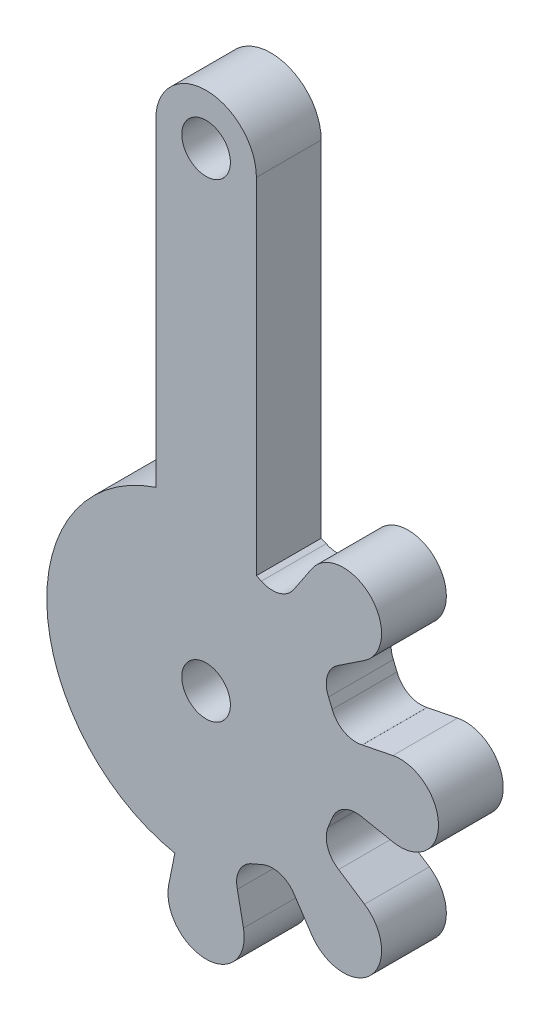
ISO-10303-21;
HEADER;
FILE_DESCRIPTION(('STEP AP214'),'2;1');
FILE_NAME('part.step','',(''),(''),'','','');
FILE_SCHEMA(('AUTOMOTIVE_DESIGN { 1 0 10303 214 1 1 1 1 }'));
ENDSEC;
DATA;
#1=APPLICATION_CONTEXT('core data for automotive mechanical design processes');
#2=APPLICATION_PROTOCOL_DEFINITION('international standard','automotive_design',2000,#1);
#3=PRODUCT_CONTEXT('',#1,'mechanical');
#4=PRODUCT('Part','Part','',(#3));
#5=PRODUCT_RELATED_PRODUCT_CATEGORY('part','',(#4));
#6=PRODUCT_DEFINITION_FORMATION('','',#4);
#7=PRODUCT_DEFINITION_CONTEXT('part definition',#1,'design');
#8=PRODUCT_DEFINITION('design','',#6,#7);
#9=PRODUCT_DEFINITION_SHAPE('','',#8);
#10=(LENGTH_UNIT() NAMED_UNIT(*) SI_UNIT(.MILLI.,.METRE.));
#11=(NAMED_UNIT(*) PLANE_ANGLE_UNIT() SI_UNIT($,.RADIAN.));
#12=(NAMED_UNIT(*) SI_UNIT($,.STERADIAN.) SOLID_ANGLE_UNIT());
#13=UNCERTAINTY_MEASURE_WITH_UNIT(LENGTH_MEASURE(1.E-05),#10,'distance_accuracy_value','');
#14=(GEOMETRIC_REPRESENTATION_CONTEXT(3) GLOBAL_UNCERTAINTY_ASSIGNED_CONTEXT((#13)) GLOBAL_UNIT_ASSIGNED_CONTEXT((#10,
#11,#12)) REPRESENTATION_CONTEXT('',''));
#15=CARTESIAN_POINT('',(0.,0.,0.));
#16=DIRECTION('',(0.,0.,1.));
#17=DIRECTION('',(1.,0.,0.));
#18=AXIS2_PLACEMENT_3D('',#15,#16,#17);
#19=CARTESIAN_POINT('',(19.0889021483885,17.7965675448827,8.00000018998981));
#20=DIRECTION('',(0.,0.,-1.));
#21=DIRECTION('',(-1.,0.,0.));
#22=AXIS2_PLACEMENT_3D('',#19,#20,#21);
#23=CYLINDRICAL_SURFACE('',#22,1.56930232516335);
#24=CARTESIAN_POINT('',(19.0889021483885,17.7965675448827,4.00000018998981));
#25=DIRECTION('',(0.,0.,1.));
#26=DIRECTION('',(1.,0.,0.));
#27=AXIS2_PLACEMENT_3D('',#24,#25,#26);
#28=CIRCLE('',#27,1.56930232516335);
#29=CARTESIAN_POINT('',(17.6195717532725,17.2454069714097,4.00000018998981));
#30=VERTEX_POINT('',#29);
#31=CARTESIAN_POINT('',(19.4732207047145,16.2750521703214,4.00000018998981));
#32=VERTEX_POINT('',#31);
#33=EDGE_CURVE('E277',#30,#32,#28,.T.);
#34=ORIENTED_EDGE('',*,*,#33,.F.);
#35=DIRECTION('',(0.,0.,-1.));
#36=VECTOR('',#35,1.);
#37=CARTESIAN_POINT('',(17.6195717532725,17.2454069714097,8.00000018998981));
#38=LINE('',#37,#36);
#39=CARTESIAN_POINT('',(17.6195717532725,17.2454069714097,8.00000018998981));
#40=VERTEX_POINT('',#39);
#41=EDGE_CURVE('E11',#40,#30,#38,.T.);
#42=ORIENTED_EDGE('',*,*,#41,.F.);
#43=CARTESIAN_POINT('',(19.0889021483885,17.7965675448827,8.00000018998981));
#44=DIRECTION('',(0.,0.,1.));
#45=DIRECTION('',(1.,0.,0.));
#46=AXIS2_PLACEMENT_3D('',#43,#44,#45);
#47=CIRCLE('',#46,1.56930232516335);
#48=CARTESIAN_POINT('',(19.4732207047145,16.2750521703214,8.00000018998981));
#49=VERTEX_POINT('',#48);
#50=EDGE_CURVE('E390',#40,#49,#47,.T.);
#51=ORIENTED_EDGE('',*,*,#50,.T.);
#52=DIRECTION('',(0.,0.,-1.));
#53=VECTOR('',#52,1.);
#54=CARTESIAN_POINT('',(19.4732207047145,16.2750521703214,8.00000018998981));
#55=LINE('',#54,#53);
#56=EDGE_CURVE('E160',#49,#32,#55,.T.);
#57=ORIENTED_EDGE('',*,*,#56,.T.);
#58=EDGE_LOOP('',(#34,#42,#51,#57));
#59=FACE_BOUND('',#58,.T.);
#60=ADVANCED_FACE('F45',(#59),#23,.F.);
#61=CARTESIAN_POINT('',(21.1359924546618,8.78995775442313,8.00000018998981));
#62=DIRECTION('',(0.923335813994052,0.38399345644938,0.));
#63=DIRECTION('',(-0.38399345644938,0.923335813994052,0.));
#64=AXIS2_PLACEMENT_3D('',#61,#62,#63);
#65=PLANE('',#64);
#66=DIRECTION('',(0.38399345644938,-0.923335813994052,0.));
#67=VECTOR('',#66,1.);
#68=CARTESIAN_POINT('',(21.1359924546618,8.78995775442313,4.00000018998981));
#69=LINE('',#68,#67);
#70=CARTESIAN_POINT('',(17.3903571485112,17.7965675448827,4.00000018998981));
#71=VERTEX_POINT('',#70);
#72=EDGE_CURVE('E281',#71,#30,#69,.T.);
#73=ORIENTED_EDGE('',*,*,#72,.F.);
#74=DIRECTION('',(0.,0.,-1.));
#75=VECTOR('',#74,1.);
#76=CARTESIAN_POINT('',(17.3903571485112,17.7965675448827,8.00000018998981));
#77=LINE('',#76,#75);
#78=CARTESIAN_POINT('',(17.3903571485112,17.7965675448827,8.00000018998981));
#79=VERTEX_POINT('',#78);
#80=EDGE_CURVE('E54',#79,#71,#77,.T.);
#81=ORIENTED_EDGE('',*,*,#80,.F.);
#82=DIRECTION('',(0.38399345644938,-0.923335813994052,0.));
#83=VECTOR('',#82,1.);
#84=CARTESIAN_POINT('',(21.1359924546618,8.78995775442313,8.00000018998981));
#85=LINE('',#84,#83);
#86=EDGE_CURVE('E495',#79,#40,#85,.T.);
#87=ORIENTED_EDGE('',*,*,#86,.T.);
#88=ORIENTED_EDGE('',*,*,#41,.T.);
#89=EDGE_LOOP('',(#73,#81,#87,#88));
#90=FACE_BOUND('',#89,.T.);
#91=ADVANCED_FACE('F482',(#90),#65,.T.);
#92=CARTESIAN_POINT('',(18.8341728434467,18.4448450137973,8.00000018998981));
#93=DIRECTION('',(0.,0.,-1.));
#94=DIRECTION('',(-1.,0.,0.));
#95=AXIS2_PLACEMENT_3D('',#92,#93,#94);
#96=CYLINDRICAL_SURFACE('',#95,1.58267730053989);
#97=CARTESIAN_POINT('',(18.8341728434467,18.4448450137973,4.00000018998981));
#98=DIRECTION('',(0.,0.,1.));
#99=DIRECTION('',(1.,0.,0.));
#100=AXIS2_PLACEMENT_3D('',#97,#98,#99);
#101=CIRCLE('',#100,1.58267730053989);
#102=CARTESIAN_POINT('',(18.0128887879995,19.7977529699837,4.00000018998981));
#103=VERTEX_POINT('',#102);
#104=EDGE_CURVE('E285',#103,#71,#101,.T.);
#105=ORIENTED_EDGE('',*,*,#104,.F.);
#106=DIRECTION('',(0.,0.,-1.));
#107=VECTOR('',#106,1.);
#108=CARTESIAN_POINT('',(18.0128887879995,19.7977529699837,8.00000018998981));
#109=LINE('',#108,#107);
#110=CARTESIAN_POINT('',(18.0128887879995,19.7977529699837,8.00000018998981));
#111=VERTEX_POINT('',#110);
#112=EDGE_CURVE('E469',#111,#103,#109,.T.);
#113=ORIENTED_EDGE('',*,*,#112,.F.);
#114=CARTESIAN_POINT('',(18.8341728434467,18.4448450137973,8.00000018998981));
#115=DIRECTION('',(0.,0.,1.));
#116=DIRECTION('',(1.,0.,0.));
#117=AXIS2_PLACEMENT_3D('',#114,#115,#116);
#118=CIRCLE('',#117,1.58267730053989);
#119=EDGE_CURVE('E478',#111,#79,#118,.T.);
#120=ORIENTED_EDGE('',*,*,#119,.T.);
#121=ORIENTED_EDGE('',*,*,#80,.T.);
#122=EDGE_LOOP('',(#105,#113,#120,#121));
#123=FACE_BOUND('',#122,.T.);
#124=ADVANCED_FACE('F476',(#123),#96,.F.);
#125=CARTESIAN_POINT('',(-3.61433091656492,5.44693007386166,8.00000018998981));
#126=DIRECTION('',(0.552903184454799,-0.833245503210034,0.));
#127=DIRECTION('',(0.833245503210034,0.552903184454799,0.));
#128=AXIS2_PLACEMENT_3D('',#125,#126,#127);
#129=PLANE('',#128);
#130=DIRECTION('',(-0.833245503210034,-0.552903184454799,0.));
#131=VECTOR('',#130,1.);
#132=CARTESIAN_POINT('',(-3.61433091656492,5.44693007386166,4.00000018998981));
#133=LINE('',#132,#131);
#134=CARTESIAN_POINT('',(19.6112202821815,20.8583318384481,4.00000018998981));
#135=VERTEX_POINT('',#134);
#136=EDGE_CURVE('E289',#135,#103,#133,.T.);
#137=ORIENTED_EDGE('',*,*,#136,.F.);
#138=DIRECTION('',(0.,0.,-1.));
#139=VECTOR('',#138,1.);
#140=CARTESIAN_POINT('',(19.6112202821815,20.8583318384481,8.00000018998981));
#141=LINE('',#140,#139);
#142=CARTESIAN_POINT('',(19.6112202821815,20.8583318384481,8.00000018998981));
#143=VERTEX_POINT('',#142);
#144=EDGE_CURVE('E466',#143,#135,#141,.T.);
#145=ORIENTED_EDGE('',*,*,#144,.F.);
#146=DIRECTION('',(-0.833245503210034,-0.552903184454799,0.));
#147=VECTOR('',#146,1.);
#148=CARTESIAN_POINT('',(-3.61433091656492,5.44693007386166,8.00000018998981));
#149=LINE('',#148,#147);
#150=EDGE_CURVE('E494',#143,#111,#149,.T.);
#151=ORIENTED_EDGE('',*,*,#150,.T.);
#152=ORIENTED_EDGE('',*,*,#112,.T.);
#153=EDGE_LOOP('',(#137,#145,#151,#152));
#154=FACE_BOUND('',#153,.T.);
#155=ADVANCED_FACE('F490',(#154),#129,.T.);
#156=CARTESIAN_POINT('',(18.3097118795859,22.8197530317846,8.00000018998981));
#157=DIRECTION('',(0.,0.,-1.));
#158=DIRECTION('',(-1.,0.,0.));
#159=AXIS2_PLACEMENT_3D('',#156,#157,#158);
#160=CYLINDRICAL_SURFACE('',#159,2.35395352963824);
#161=CARTESIAN_POINT('',(18.3097118795859,22.8197530317846,4.00000018998981));
#162=DIRECTION('',(0.,0.,1.));
#163=DIRECTION('',(1.,0.,0.));
#164=AXIS2_PLACEMENT_3D('',#161,#162,#163);
#165=CIRCLE('',#164,2.35395352963824);
#166=CARTESIAN_POINT('',(16.3503750204185,24.1243971564424,4.00000018998981));
#167=VERTEX_POINT('',#166);
#168=EDGE_CURVE('E293',#135,#167,#165,.T.);
#169=ORIENTED_EDGE('',*,*,#168,.T.);
#170=DIRECTION('',(0.,0.,-1.));
#171=VECTOR('',#170,1.);
#172=CARTESIAN_POINT('',(16.3503750204185,24.1243971564424,8.00000018998981));
#173=LINE('',#172,#171);
#174=CARTESIAN_POINT('',(16.3503750204185,24.1243971564424,8.00000018998981));
#175=VERTEX_POINT('',#174);
#176=EDGE_CURVE('E462',#175,#167,#173,.T.);
#177=ORIENTED_EDGE('',*,*,#176,.F.);
#178=CARTESIAN_POINT('',(18.3097118795859,22.8197530317846,8.00000018998981));
#179=DIRECTION('',(0.,0.,1.));
#180=DIRECTION('',(1.,0.,0.));
#181=AXIS2_PLACEMENT_3D('',#178,#179,#180);
#182=CIRCLE('',#181,2.35395352963824);
#183=EDGE_CURVE('E500',#143,#175,#182,.T.);
#184=ORIENTED_EDGE('',*,*,#183,.F.);
#185=ORIENTED_EDGE('',*,*,#144,.T.);
#186=EDGE_LOOP('',(#169,#177,#184,#185));
#187=FACE_BOUND('',#186,.T.);
#188=ADVANCED_FACE('F595',(#187),#160,.T.);
#189=CARTESIAN_POINT('',(0.198772996920888,-0.132354996212168,8.00000018998981));
#190=DIRECTION('',(0.832360042157906,-0.554235293191339,0.));
#191=DIRECTION('',(0.554235293191339,0.832360042157906,0.));
#192=AXIS2_PLACEMENT_3D('',#189,#190,#191);
#193=PLANE('',#192);
#194=DIRECTION('',(-0.554235293191339,-0.832360042157906,0.));
#195=VECTOR('',#194,1.);
#196=CARTESIAN_POINT('',(0.198772996920888,-0.132354996212168,4.00000018998981));
#197=LINE('',#196,#195);
#198=CARTESIAN_POINT('',(15.2851562947721,22.524633456298,4.00000018998981));
#199=VERTEX_POINT('',#198);
#200=EDGE_CURVE('E296',#167,#199,#197,.T.);
#201=ORIENTED_EDGE('',*,*,#200,.T.);
#202=DIRECTION('',(0.,0.,-1.));
#203=VECTOR('',#202,1.);
#204=CARTESIAN_POINT('',(15.2851562947721,22.524633456298,8.00000018998981));
#205=LINE('',#204,#203);
#206=CARTESIAN_POINT('',(15.2851562947721,22.524633456298,8.00000018998981));
#207=VERTEX_POINT('',#206);
#208=EDGE_CURVE('E458',#207,#199,#205,.T.);
#209=ORIENTED_EDGE('',*,*,#208,.F.);
#210=DIRECTION('',(-0.554235293191339,-0.832360042157906,0.));
#211=VECTOR('',#210,1.);
#212=CARTESIAN_POINT('',(0.198772996920888,-0.132354996212168,8.00000018998981));
#213=LINE('',#212,#211);
#214=EDGE_CURVE('E507',#175,#207,#213,.T.);
#215=ORIENTED_EDGE('',*,*,#214,.F.);
#216=ORIENTED_EDGE('',*,*,#176,.T.);
#217=EDGE_LOOP('',(#201,#209,#215,#216));
#218=FACE_BOUND('',#217,.T.);
#219=ADVANCED_FACE('F598',(#218),#193,.F.);
#220=CARTESIAN_POINT('',(9.83250101066569,14.3425418775039,8.00000018998981));
#221=DIRECTION('',(0.,0.,-1.));
#222=DIRECTION('',(-1.,0.,0.));
#223=AXIS2_PLACEMENT_3D('',#220,#221,#222);
#224=CYLINDRICAL_SURFACE('',#223,9.83250081368247);
#225=CARTESIAN_POINT('',(9.83250101066569,14.3425418775039,4.00000018998981));
#226=DIRECTION('',(0.,0.,1.));
#227=DIRECTION('',(1.,0.,0.));
#228=AXIS2_PLACEMENT_3D('',#225,#226,#227);
#229=CIRCLE('',#228,9.83250081368247);
#230=CARTESIAN_POINT('',(15.2830266027005,22.5260523113972,4.00000018998981));
#231=VERTEX_POINT('',#230);
#232=EDGE_CURVE('E299',#199,#231,#229,.T.);
#233=ORIENTED_EDGE('',*,*,#232,.T.);
#234=DIRECTION('',(0.,0.,-1.));
#235=VECTOR('',#234,1.);
#236=CARTESIAN_POINT('',(15.2830266027005,22.5260523113972,8.00000018998981));
#237=LINE('',#236,#235);
#238=CARTESIAN_POINT('',(15.2830266027005,22.5260523113972,8.00000018998981));
#239=VERTEX_POINT('',#238);
#240=EDGE_CURVE('E455',#239,#231,#237,.T.);
#241=ORIENTED_EDGE('',*,*,#240,.F.);
#242=CARTESIAN_POINT('',(9.83250101066569,14.3425418775039,8.00000018998981));
#243=DIRECTION('',(0.,0.,1.));
#244=DIRECTION('',(1.,0.,0.));
#245=AXIS2_PLACEMENT_3D('',#242,#243,#244);
#246=CIRCLE('',#245,9.83250081368247);
#247=EDGE_CURVE('E510',#207,#239,#246,.T.);
#248=ORIENTED_EDGE('',*,*,#247,.F.);
#249=ORIENTED_EDGE('',*,*,#208,.T.);
#250=EDGE_LOOP('',(#233,#241,#248,#249));
#251=FACE_BOUND('',#250,.T.);
#252=ADVANCED_FACE('F602',(#251),#224,.T.);
#253=CARTESIAN_POINT('',(13.9353991992036,23.3301692181327,8.00000018998981));
#254=DIRECTION('',(0.,0.,-1.));
#255=DIRECTION('',(-1.,0.,0.));
#256=AXIS2_PLACEMENT_3D('',#253,#254,#255);
#257=CYLINDRICAL_SURFACE('',#256,1.56930035950858);
#258=CARTESIAN_POINT('',(13.9353991992036,23.3301692181327,4.00000018998981));
#259=DIRECTION('',(0.,0.,1.));
#260=DIRECTION('',(1.,0.,0.));
#261=AXIS2_PLACEMENT_3D('',#258,#259,#260);
#262=CIRCLE('',#261,1.56930035950858);
#263=CARTESIAN_POINT('',(13.2481702620322,21.9193467607456,4.00000018998981));
#264=VERTEX_POINT('',#263);
#265=EDGE_CURVE('E303',#264,#231,#262,.T.);
#266=ORIENTED_EDGE('',*,*,#265,.F.);
#267=DIRECTION('',(0.,0.,-1.));
#268=VECTOR('',#267,1.);
#269=CARTESIAN_POINT('',(13.2481702620322,21.9193467607456,8.00000018998981));
#270=LINE('',#269,#268);
#271=CARTESIAN_POINT('',(13.2481702620322,21.9193467607456,8.00000018998981));
#272=VERTEX_POINT('',#271);
#273=EDGE_CURVE('E452',#272,#264,#270,.T.);
#274=ORIENTED_EDGE('',*,*,#273,.F.);
#275=CARTESIAN_POINT('',(13.9353991992036,23.3301692181327,8.00000018998981));
#276=DIRECTION('',(0.,0.,1.));
#277=DIRECTION('',(1.,0.,0.));
#278=AXIS2_PLACEMENT_3D('',#275,#276,#277);
#279=CIRCLE('',#278,1.56930035950858);
#280=EDGE_CURVE('E513',#272,#239,#279,.T.);
#281=ORIENTED_EDGE('',*,*,#280,.T.);
#282=ORIENTED_EDGE('',*,*,#240,.T.);
#283=EDGE_LOOP('',(#266,#274,#281,#282));
#284=FACE_BOUND('',#283,.T.);
#285=ADVANCED_FACE('F606',(#284),#257,.F.);
#286=CARTESIAN_POINT('',(9.90775496170879,23.3374945485105,8.00000018998981));
#287=DIRECTION('',(0.390783807057663,0.920482490947828,0.));
#288=DIRECTION('',(-0.920482490947828,0.390783807057663,0.));
#289=AXIS2_PLACEMENT_3D('',#286,#287,#288);
#290=PLANE('',#289);
#291=DIRECTION('',(0.920482490947828,-0.390783807057663,0.));
#292=VECTOR('',#291,1.);
#293=CARTESIAN_POINT('',(9.90775496170879,23.3374945485105,4.00000018998981));
#294=LINE('',#293,#292);
#295=CARTESIAN_POINT('',(12.937500141561,22.0512393862009,4.00000018998981));
#296=VERTEX_POINT('',#295);
#297=EDGE_CURVE('E307',#296,#264,#294,.T.);
#298=ORIENTED_EDGE('',*,*,#297,.F.);
#299=DIRECTION('',(0.,0.,-1.));
#300=VECTOR('',#299,1.);
#301=CARTESIAN_POINT('',(12.937500141561,22.0512393862009,8.00000018998981));
#302=LINE('',#301,#300);
#303=CARTESIAN_POINT('',(12.937500141561,22.0512393862009,8.00000018998981));
#304=VERTEX_POINT('',#303);
#305=EDGE_CURVE('E449',#304,#296,#302,.T.);
#306=ORIENTED_EDGE('',*,*,#305,.F.);
#307=DIRECTION('',(0.920482490947828,-0.390783807057663,0.));
#308=VECTOR('',#307,1.);
#309=CARTESIAN_POINT('',(9.90775496170879,23.3374945485105,8.00000018998981));
#310=LINE('',#309,#308);
#311=EDGE_CURVE('E517',#304,#272,#310,.T.);
#312=ORIENTED_EDGE('',*,*,#311,.T.);
#313=ORIENTED_EDGE('',*,*,#273,.T.);
#314=EDGE_LOOP('',(#298,#306,#312,#313));
#315=FACE_BOUND('',#314,.T.);
#316=ADVANCED_FACE('F610',(#315),#290,.T.);
#317=CARTESIAN_POINT('',(12.9375001415587,-1.38479881519464E-12,8.00000018998981));
#318=DIRECTION('',(1.,-1.07037588409085E-13,0.));
#319=DIRECTION('',(1.07037588409085E-13,1.,0.));
#320=AXIS2_PLACEMENT_3D('',#317,#318,#319);
#321=PLANE('',#320);
#322=DIRECTION('',(-1.07037588409085E-13,-1.,0.));
#323=VECTOR('',#322,1.);
#324=CARTESIAN_POINT('',(12.9375001415587,-1.38479881519464E-12,4.00000018998981));
#325=LINE('',#324,#323);
#326=CARTESIAN_POINT('',(12.937500141561,43.3425419032574,4.00000018998981));
#327=VERTEX_POINT('',#326);
#328=EDGE_CURVE('E311',#327,#296,#325,.T.);
#329=ORIENTED_EDGE('',*,*,#328,.F.);
#330=DIRECTION('',(0.,0.,-1.));
#331=VECTOR('',#330,1.);
#332=CARTESIAN_POINT('',(12.937500141561,43.3425419032574,8.00000018998981));
#333=LINE('',#332,#331);
#334=CARTESIAN_POINT('',(12.937500141561,43.3425419032574,8.00000018998981));
#335=VERTEX_POINT('',#334);
#336=EDGE_CURVE('E446',#335,#327,#333,.T.);
#337=ORIENTED_EDGE('',*,*,#336,.F.);
#338=DIRECTION('',(-1.07037588409085E-13,-1.,0.));
#339=VECTOR('',#338,1.);
#340=CARTESIAN_POINT('',(12.9375001415587,-1.38479881519464E-12,8.00000018998981));
#341=LINE('',#340,#339);
#342=EDGE_CURVE('E521',#335,#304,#341,.T.);
#343=ORIENTED_EDGE('',*,*,#342,.T.);
#344=ORIENTED_EDGE('',*,*,#305,.T.);
#345=EDGE_LOOP('',(#329,#337,#343,#344));
#346=FACE_BOUND('',#345,.T.);
#347=ADVANCED_FACE('F614',(#346),#321,.T.);
#348=CARTESIAN_POINT('',(9.83250024728477,43.3425408664107,8.00000018998981));
#349=DIRECTION('',(0.,0.,-1.));
#350=DIRECTION('',(-1.,0.,0.));
#351=AXIS2_PLACEMENT_3D('',#348,#349,#350);
#352=CYLINDRICAL_SURFACE('',#351,3.10499989427643);
#353=CARTESIAN_POINT('',(9.83250024728477,43.3425408664107,4.00000018998981));
#354=DIRECTION('',(0.,0.,1.));
#355=DIRECTION('',(1.,0.,0.));
#356=AXIS2_PLACEMENT_3D('',#353,#354,#355);
#357=CIRCLE('',#356,3.10499989427643);
#358=CARTESIAN_POINT('',(6.72750035300834,43.3425408664107,4.00000018998981));
#359=VERTEX_POINT('',#358);
#360=EDGE_CURVE('E315',#327,#359,#357,.T.);
#361=ORIENTED_EDGE('',*,*,#360,.T.);
#362=DIRECTION('',(0.,0.,-1.));
#363=VECTOR('',#362,1.);
#364=CARTESIAN_POINT('',(6.72750035300834,43.3425408664107,8.00000018998981));
#365=LINE('',#364,#363);
#366=CARTESIAN_POINT('',(6.72750035300834,43.3425408664107,8.00000018998981));
#367=VERTEX_POINT('',#366);
#368=EDGE_CURVE('E442',#367,#359,#365,.T.);
#369=ORIENTED_EDGE('',*,*,#368,.F.);
#370=CARTESIAN_POINT('',(9.83250024728477,43.3425408664107,8.00000018998981));
#371=DIRECTION('',(0.,0.,1.));
#372=DIRECTION('',(1.,0.,0.));
#373=AXIS2_PLACEMENT_3D('',#370,#371,#372);
#374=CIRCLE('',#373,3.10499989427643);
#375=EDGE_CURVE('E525',#335,#367,#374,.T.);
#376=ORIENTED_EDGE('',*,*,#375,.F.);
#377=ORIENTED_EDGE('',*,*,#336,.T.);
#378=EDGE_LOOP('',(#361,#369,#376,#377));
#379=FACE_BOUND('',#378,.T.);
#380=ADVANCED_FACE('F618',(#379),#352,.T.);
#381=CARTESIAN_POINT('',(6.72750035300834,0.,8.00000018998981));
#382=DIRECTION('',(1.,0.,0.));
#383=DIRECTION('',(0.,0.,-1.));
#384=AXIS2_PLACEMENT_3D('',#381,#382,#383);
#385=PLANE('',#384);
#386=DIRECTION('',(0.,-1.,0.));
#387=VECTOR('',#386,1.);
#388=CARTESIAN_POINT('',(6.72750035300834,0.,4.00000018998981));
#389=LINE('',#388,#387);
#390=CARTESIAN_POINT('',(6.72750035300834,23.6719064414501,4.00000018998981));
#391=VERTEX_POINT('',#390);
#392=EDGE_CURVE('E318',#359,#391,#389,.T.);
#393=ORIENTED_EDGE('',*,*,#392,.T.);
#394=DIRECTION('',(0.,0.,-1.));
#395=VECTOR('',#394,1.);
#396=CARTESIAN_POINT('',(6.72750035300834,23.6719064414501,8.00000018998981));
#397=LINE('',#396,#395);
#398=CARTESIAN_POINT('',(6.72750035300834,23.6719064414501,8.00000018998981));
#399=VERTEX_POINT('',#398);
#400=EDGE_CURVE('E438',#399,#391,#397,.T.);
#401=ORIENTED_EDGE('',*,*,#400,.F.);
#402=DIRECTION('',(0.,-1.,0.));
#403=VECTOR('',#402,1.);
#404=CARTESIAN_POINT('',(6.72750035300834,0.,8.00000018998981));
#405=LINE('',#404,#403);
#406=EDGE_CURVE('E528',#367,#399,#405,.T.);
#407=ORIENTED_EDGE('',*,*,#406,.F.);
#408=ORIENTED_EDGE('',*,*,#368,.T.);
#409=EDGE_LOOP('',(#393,#401,#407,#408));
#410=FACE_BOUND('',#409,.T.);
#411=ADVANCED_FACE('F622',(#410),#385,.F.);
#412=CARTESIAN_POINT('',(9.83250101066569,14.3425418775039,8.00000018998981));
#413=DIRECTION('',(0.,0.,-1.));
#414=DIRECTION('',(-1.,0.,0.));
#415=AXIS2_PLACEMENT_3D('',#412,#413,#414);
#416=CYLINDRICAL_SURFACE('',#415,9.83250081368247);
#417=CARTESIAN_POINT('',(9.83250101066569,14.3425418775039,4.00000018998981));
#418=DIRECTION('',(0.,0.,1.));
#419=DIRECTION('',(1.,0.,0.));
#420=AXIS2_PLACEMENT_3D('',#417,#418,#419);
#421=CIRCLE('',#420,9.83250081368247);
#422=CARTESIAN_POINT('',(7.90210532729955,4.70139854506105,4.00000018998981));
#423=VERTEX_POINT('',#422);
#424=EDGE_CURVE('E321',#391,#423,#421,.T.);
#425=ORIENTED_EDGE('',*,*,#424,.T.);
#426=DIRECTION('',(0.,0.,-1.));
#427=VECTOR('',#426,1.);
#428=CARTESIAN_POINT('',(7.90210532729955,4.70139854506105,8.00000018998981));
#429=LINE('',#428,#427);
#430=CARTESIAN_POINT('',(7.90210532729955,4.70139854506105,8.00000018998981));
#431=VERTEX_POINT('',#430);
#432=EDGE_CURVE('E435',#431,#423,#429,.T.);
#433=ORIENTED_EDGE('',*,*,#432,.F.);
#434=CARTESIAN_POINT('',(9.83250101066569,14.3425418775039,8.00000018998981));
#435=DIRECTION('',(0.,0.,1.));
#436=DIRECTION('',(1.,0.,0.));
#437=AXIS2_PLACEMENT_3D('',#434,#435,#436);
#438=CIRCLE('',#437,9.83250081368247);
#439=EDGE_CURVE('E531',#399,#431,#438,.T.);
#440=ORIENTED_EDGE('',*,*,#439,.F.);
#441=ORIENTED_EDGE('',*,*,#400,.T.);
#442=EDGE_LOOP('',(#425,#433,#440,#441));
#443=FACE_BOUND('',#442,.T.);
#444=ADVANCED_FACE('F626',(#443),#416,.T.);
#445=CARTESIAN_POINT('',(6.69148391120007,-1.34072874359812,8.00000018998981));
#446=DIRECTION('',(-0.980512085332624,0.196458775616336,0.));
#447=DIRECTION('',(-0.196458775616336,-0.980512085332624,0.));
#448=AXIS2_PLACEMENT_3D('',#445,#446,#447);
#449=PLANE('',#448);
#450=DIRECTION('',(0.196458775616336,0.980512085332624,0.));
#451=VECTOR('',#450,1.);
#452=CARTESIAN_POINT('',(6.69148391120007,-1.34072874359812,4.00000018998981));
#453=LINE('',#452,#451);
#454=CARTESIAN_POINT('',(7.52442178923231,2.81640627457414,4.00000018998981));
#455=VERTEX_POINT('',#454);
#456=EDGE_CURVE('E325',#455,#423,#453,.T.);
#457=ORIENTED_EDGE('',*,*,#456,.F.);
#458=DIRECTION('',(0.,0.,-1.));
#459=VECTOR('',#458,1.);
#460=CARTESIAN_POINT('',(7.52442178923231,2.81640627457414,8.00000018998981));
#461=LINE('',#460,#459);
#462=CARTESIAN_POINT('',(7.52442178923231,2.81640627457414,8.00000018998981));
#463=VERTEX_POINT('',#462);
#464=EDGE_CURVE('E432',#463,#455,#461,.T.);
#465=ORIENTED_EDGE('',*,*,#464,.F.);
#466=DIRECTION('',(0.196458775616336,0.980512085332624,0.));
#467=VECTOR('',#466,1.);
#468=CARTESIAN_POINT('',(6.69148391120007,-1.34072874359812,8.00000018998981));
#469=LINE('',#468,#467);
#470=EDGE_CURVE('E534',#463,#431,#469,.T.);
#471=ORIENTED_EDGE('',*,*,#470,.T.);
#472=ORIENTED_EDGE('',*,*,#432,.T.);
#473=EDGE_LOOP('',(#457,#465,#471,#472));
#474=FACE_BOUND('',#473,.T.);
#475=ADVANCED_FACE('F630',(#474),#449,.T.);
#476=CARTESIAN_POINT('',(9.83250001445413,2.35395177866654,8.00000018998981));
#477=DIRECTION('',(0.,0.,-1.));
#478=DIRECTION('',(-1.,0.,0.));
#479=AXIS2_PLACEMENT_3D('',#476,#477,#478);
#480=CYLINDRICAL_SURFACE('',#479,2.35395183776734);
#481=CARTESIAN_POINT('',(9.83250001445413,2.35395177866654,4.00000018998981));
#482=DIRECTION('',(0.,0.,1.));
#483=DIRECTION('',(1.,0.,0.));
#484=AXIS2_PLACEMENT_3D('',#481,#482,#483);
#485=CIRCLE('',#484,2.35395183776734);
#486=CARTESIAN_POINT('',(12.1405782396759,2.81640627457414,4.00000018998981));
#487=VERTEX_POINT('',#486);
#488=EDGE_CURVE('E329',#455,#487,#485,.T.);
#489=ORIENTED_EDGE('',*,*,#488,.T.);
#490=DIRECTION('',(0.,0.,-1.));
#491=VECTOR('',#490,1.);
#492=CARTESIAN_POINT('',(12.1405782396759,2.81640627457414,8.00000018998981));
#493=LINE('',#492,#491);
#494=CARTESIAN_POINT('',(12.1405782396759,2.81640627457414,8.00000018998981));
#495=VERTEX_POINT('',#494);
#496=EDGE_CURVE('E428',#495,#487,#493,.T.);
#497=ORIENTED_EDGE('',*,*,#496,.F.);
#498=CARTESIAN_POINT('',(9.83250001445413,2.35395177866654,8.00000018998981));
#499=DIRECTION('',(0.,0.,1.));
#500=DIRECTION('',(1.,0.,0.));
#501=AXIS2_PLACEMENT_3D('',#498,#499,#500);
#502=CIRCLE('',#501,2.35395183776734);
#503=EDGE_CURVE('E538',#463,#495,#502,.T.);
#504=ORIENTED_EDGE('',*,*,#503,.F.);
#505=ORIENTED_EDGE('',*,*,#464,.T.);
#506=EDGE_LOOP('',(#489,#497,#504,#505));
#507=FACE_BOUND('',#506,.T.);
#508=ADVANCED_FACE('F634',(#507),#480,.T.);
#509=CARTESIAN_POINT('',(12.2145247831821,2.44734421893973,8.00000018998981));
#510=DIRECTION('',(-0.980512085332624,-0.196458775616335,0.));
#511=DIRECTION('',(0.196458775616335,-0.980512085332624,0.));
#512=AXIS2_PLACEMENT_3D('',#509,#510,#511);
#513=PLANE('',#512);
#514=DIRECTION('',(-0.196458775616335,0.980512085332624,0.));
#515=VECTOR('',#514,1.);
#516=CARTESIAN_POINT('',(12.2145247831821,2.44734421893973,4.00000018998981));
#517=LINE('',#516,#515);
#518=CARTESIAN_POINT('',(11.7628947784572,4.70139816151575,4.00000018998981));
#519=VERTEX_POINT('',#518);
#520=EDGE_CURVE('E332',#487,#519,#517,.T.);
#521=ORIENTED_EDGE('',*,*,#520,.T.);
#522=DIRECTION('',(0.,0.,-1.));
#523=VECTOR('',#522,1.);
#524=CARTESIAN_POINT('',(11.7628947784572,4.70139816151575,8.00000018998981));
#525=LINE('',#524,#523);
#526=CARTESIAN_POINT('',(11.7628947784572,4.70139816151575,8.00000018998981));
#527=VERTEX_POINT('',#526);
#528=EDGE_CURVE('E425',#527,#519,#525,.T.);
#529=ORIENTED_EDGE('',*,*,#528,.F.);
#530=DIRECTION('',(-0.196458775616335,0.980512085332624,0.));
#531=VECTOR('',#530,1.);
#532=CARTESIAN_POINT('',(12.2145247831821,2.44734421893973,8.00000018998981));
#533=LINE('',#532,#531);
#534=EDGE_CURVE('E541',#495,#527,#533,.T.);
#535=ORIENTED_EDGE('',*,*,#534,.F.);
#536=ORIENTED_EDGE('',*,*,#496,.T.);
#537=EDGE_LOOP('',(#521,#529,#535,#536));
#538=FACE_BOUND('',#537,.T.);
#539=ADVANCED_FACE('F638',(#538),#513,.F.);
#540=CARTESIAN_POINT('',(13.2749341416946,5.08388406319837,8.00000018998981));
#541=DIRECTION('',(0.,0.,-1.));
#542=DIRECTION('',(-1.,0.,0.));
#543=AXIS2_PLACEMENT_3D('',#540,#541,#542);
#544=CYLINDRICAL_SURFACE('',#543,1.55966615048398);
#545=CARTESIAN_POINT('',(13.2749341416946,5.08388406319837,4.00000018998981));
#546=DIRECTION('',(0.,0.,1.));
#547=DIRECTION('',(1.,0.,0.));
#548=AXIS2_PLACEMENT_3D('',#545,#546,#547);
#549=CIRCLE('',#548,1.55966615048398);
#550=CARTESIAN_POINT('',(12.7382591657406,6.54830834295825,4.00000018998981));
#551=VERTEX_POINT('',#550);
#552=EDGE_CURVE('E336',#551,#519,#549,.T.);
#553=ORIENTED_EDGE('',*,*,#552,.F.);
#554=DIRECTION('',(0.,0.,-1.));
#555=VECTOR('',#554,1.);
#556=CARTESIAN_POINT('',(12.7382591657406,6.54830834295825,8.00000018998981));
#557=LINE('',#556,#555);
#558=CARTESIAN_POINT('',(12.7382591657406,6.54830834295825,8.00000018998981));
#559=VERTEX_POINT('',#558);
#560=EDGE_CURVE('E422',#559,#551,#557,.T.);
#561=ORIENTED_EDGE('',*,*,#560,.F.);
#562=CARTESIAN_POINT('',(13.2749341416946,5.08388406319837,8.00000018998981));
#563=DIRECTION('',(0.,0.,1.));
#564=DIRECTION('',(1.,0.,0.));
#565=AXIS2_PLACEMENT_3D('',#562,#563,#564);
#566=CIRCLE('',#565,1.55966615048398);
#567=EDGE_CURVE('E544',#559,#527,#566,.T.);
#568=ORIENTED_EDGE('',*,*,#567,.T.);
#569=ORIENTED_EDGE('',*,*,#528,.T.);
#570=EDGE_LOOP('',(#553,#561,#568,#569));
#571=FACE_BOUND('',#570,.T.);
#572=ADVANCED_FACE('F642',(#571),#544,.F.);
#573=CARTESIAN_POINT('',(-0.371900803995508,0.856633436229976,8.00000018998981));
#574=DIRECTION('',(-0.398232080204369,0.917284694244977,0.));
#575=DIRECTION('',(-0.917284694244977,-0.398232080204369,0.));
#576=AXIS2_PLACEMENT_3D('',#573,#574,#575);
#577=PLANE('',#576);
#578=DIRECTION('',(0.917284694244977,0.398232080204369,0.));
#579=VECTOR('',#578,1.);
#580=CARTESIAN_POINT('',(-0.371900803995508,0.856633436229976,4.00000018998981));
#581=LINE('',#580,#579);
#582=CARTESIAN_POINT('',(13.2798130229038,6.78341977611949,4.00000018998981));
#583=VERTEX_POINT('',#582);
#584=EDGE_CURVE('E340',#551,#583,#581,.T.);
#585=ORIENTED_EDGE('',*,*,#584,.T.);
#586=DIRECTION('',(0.,0.,-1.));
#587=VECTOR('',#586,1.);
#588=CARTESIAN_POINT('',(13.2798130229038,6.78341977611949,8.00000018998981));
#589=LINE('',#588,#587);
#590=CARTESIAN_POINT('',(13.2798130229038,6.78341977611949,8.00000018998981));
#591=VERTEX_POINT('',#590);
#592=EDGE_CURVE('E419',#591,#583,#589,.T.);
#593=ORIENTED_EDGE('',*,*,#592,.F.);
#594=DIRECTION('',(0.917284694244977,0.398232080204369,0.));
#595=VECTOR('',#594,1.);
#596=CARTESIAN_POINT('',(-0.371900803995508,0.856633436229976,8.00000018998981));
#597=LINE('',#596,#595);
#598=EDGE_CURVE('E548',#559,#591,#597,.T.);
#599=ORIENTED_EDGE('',*,*,#598,.F.);
#600=ORIENTED_EDGE('',*,*,#560,.T.);
#601=EDGE_LOOP('',(#585,#593,#599,#600));
#602=FACE_BOUND('',#601,.T.);
#603=ADVANCED_FACE('F646',(#602),#577,.F.);
#604=CARTESIAN_POINT('',(13.9337755720326,5.34943795461679,8.00000018998981));
#605=DIRECTION('',(0.,0.,-1.));
#606=DIRECTION('',(-1.,0.,0.));
#607=AXIS2_PLACEMENT_3D('',#604,#605,#606);
#608=CYLINDRICAL_SURFACE('',#607,1.57606182621852);
#609=CARTESIAN_POINT('',(13.9337755720326,5.34943795461679,4.00000018998981));
#610=DIRECTION('',(0.,0.,1.));
#611=DIRECTION('',(1.,0.,0.));
#612=AXIS2_PLACEMENT_3D('',#609,#610,#611);
#613=CIRCLE('',#612,1.57606182621852);
#614=CARTESIAN_POINT('',(15.2851562947721,6.16045029870986,4.00000018998981));
#615=VERTEX_POINT('',#614);
#616=EDGE_CURVE('E344',#615,#583,#613,.T.);
#617=ORIENTED_EDGE('',*,*,#616,.F.);
#618=DIRECTION('',(0.,0.,-1.));
#619=VECTOR('',#618,1.);
#620=CARTESIAN_POINT('',(15.2851562947721,6.16045029870986,8.00000018998981));
#621=LINE('',#620,#619);
#622=CARTESIAN_POINT('',(15.2851562947721,6.16045029870986,8.00000018998981));
#623=VERTEX_POINT('',#622);
#624=EDGE_CURVE('E416',#623,#615,#621,.T.);
#625=ORIENTED_EDGE('',*,*,#624,.F.);
#626=CARTESIAN_POINT('',(13.9337755720326,5.34943795461679,8.00000018998981));
#627=DIRECTION('',(0.,0.,1.));
#628=DIRECTION('',(1.,0.,0.));
#629=AXIS2_PLACEMENT_3D('',#626,#627,#628);
#630=CIRCLE('',#629,1.57606182621852);
#631=EDGE_CURVE('E551',#623,#591,#630,.T.);
#632=ORIENTED_EDGE('',*,*,#631,.T.);
#633=ORIENTED_EDGE('',*,*,#592,.T.);
#634=EDGE_LOOP('',(#617,#625,#632,#633));
#635=FACE_BOUND('',#634,.T.);
#636=ADVANCED_FACE('F650',(#635),#608,.F.);
#637=CARTESIAN_POINT('',(13.4273745704359,8.94818203855331,8.00000018998981));
#638=DIRECTION('',(-0.832147561829666,-0.554554267264208,0.));
#639=DIRECTION('',(0.554554267264208,-0.832147561829666,0.));
#640=AXIS2_PLACEMENT_3D('',#637,#638,#639);
#641=PLANE('',#640);
#642=DIRECTION('',(-0.554554267264208,0.832147561829666,0.));
#643=VECTOR('',#642,1.);
#644=CARTESIAN_POINT('',(13.4273745704359,8.94818203855331,4.00000018998981));
#645=LINE('',#644,#643);
#646=CARTESIAN_POINT('',(16.318864329397,4.60929891202859,4.00000018998981));
#647=VERTEX_POINT('',#646);
#648=EDGE_CURVE('E348',#647,#615,#645,.T.);
#649=ORIENTED_EDGE('',*,*,#648,.F.);
#650=DIRECTION('',(0.,0.,-1.));
#651=VECTOR('',#650,1.);
#652=CARTESIAN_POINT('',(16.318864329397,4.60929891202859,8.00000018998981));
#653=LINE('',#652,#651);
#654=CARTESIAN_POINT('',(16.318864329397,4.60929891202859,8.00000018998981));
#655=VERTEX_POINT('',#654);
#656=EDGE_CURVE('E413',#655,#647,#653,.T.);
#657=ORIENTED_EDGE('',*,*,#656,.F.);
#658=DIRECTION('',(-0.554554267264208,0.832147561829666,0.));
#659=VECTOR('',#658,1.);
#660=CARTESIAN_POINT('',(13.4273745704359,8.94818203855331,8.00000018998981));
#661=LINE('',#660,#659);
#662=EDGE_CURVE('E555',#655,#623,#661,.T.);
#663=ORIENTED_EDGE('',*,*,#662,.T.);
#664=ORIENTED_EDGE('',*,*,#624,.T.);
#665=EDGE_LOOP('',(#649,#657,#663,#664));
#666=FACE_BOUND('',#665,.T.);
#667=ADVANCED_FACE('F654',(#666),#641,.T.);
#668=CARTESIAN_POINT('',(18.3097134949587,5.8653286053496,8.00000018998981));
#669=DIRECTION('',(0.,0.,-1.));
#670=DIRECTION('',(-1.,0.,0.));
#671=AXIS2_PLACEMENT_3D('',#668,#669,#670);
#672=CYLINDRICAL_SURFACE('',#671,2.35395220650753);
#673=CARTESIAN_POINT('',(18.3097134949587,5.8653286053496,4.00000018998981));
#674=DIRECTION('',(0.,0.,1.));
#675=DIRECTION('',(1.,0.,0.));
#676=AXIS2_PLACEMENT_3D('',#673,#674,#675);
#677=CIRCLE('',#676,2.35395220650753);
#678=CARTESIAN_POINT('',(19.6112234101304,7.82674720708444,4.00000018998981));
#679=VERTEX_POINT('',#678);
#680=EDGE_CURVE('E352',#647,#679,#677,.T.);
#681=ORIENTED_EDGE('',*,*,#680,.T.);
#682=DIRECTION('',(0.,0.,-1.));
#683=VECTOR('',#682,1.);
#684=CARTESIAN_POINT('',(19.6112234101304,7.82674720708444,8.00000018998981));
#685=LINE('',#684,#683);
#686=CARTESIAN_POINT('',(19.6112234101304,7.82674720708444,8.00000018998981));
#687=VERTEX_POINT('',#686);
#688=EDGE_CURVE('E409',#687,#679,#685,.T.);
#689=ORIENTED_EDGE('',*,*,#688,.F.);
#690=CARTESIAN_POINT('',(18.3097134949587,5.8653286053496,8.00000018998981));
#691=DIRECTION('',(0.,0.,1.));
#692=DIRECTION('',(1.,0.,0.));
#693=AXIS2_PLACEMENT_3D('',#690,#691,#692);
#694=CIRCLE('',#693,2.35395220650753);
#695=EDGE_CURVE('E559',#655,#687,#694,.T.);
#696=ORIENTED_EDGE('',*,*,#695,.F.);
#697=ORIENTED_EDGE('',*,*,#656,.T.);
#698=EDGE_LOOP('',(#681,#689,#696,#697));
#699=FACE_BOUND('',#698,.T.);
#700=ADVANCED_FACE('F658',(#699),#672,.T.);
#701=CARTESIAN_POINT('',(9.60102749418364,14.4690668148889,8.00000018998981));
#702=DIRECTION('',(-0.552904137804345,-0.833244870610575,0.));
#703=DIRECTION('',(0.833244870610575,-0.552904137804345,0.));
#704=AXIS2_PLACEMENT_3D('',#701,#702,#703);
#705=PLANE('',#704);
#706=DIRECTION('',(-0.833244870610575,0.552904137804345,0.));
#707=VECTOR('',#706,1.);
#708=CARTESIAN_POINT('',(9.60102749418364,14.4690668148889,4.00000018998981));
#709=LINE('',#708,#707);
#710=CARTESIAN_POINT('',(18.0128887879995,8.8873307850242,4.00000018998981));
#711=VERTEX_POINT('',#710);
#712=EDGE_CURVE('E355',#679,#711,#709,.T.);
#713=ORIENTED_EDGE('',*,*,#712,.T.);
#714=DIRECTION('',(0.,0.,-1.));
#715=VECTOR('',#714,1.);
#716=CARTESIAN_POINT('',(18.0128887879995,8.8873307850242,8.00000018998981));
#717=LINE('',#716,#715);
#718=CARTESIAN_POINT('',(18.0128887879995,8.8873307850242,8.00000018998981));
#719=VERTEX_POINT('',#718);
#720=EDGE_CURVE('E406',#719,#711,#717,.T.);
#721=ORIENTED_EDGE('',*,*,#720,.F.);
#722=DIRECTION('',(-0.833244870610575,0.552904137804345,0.));
#723=VECTOR('',#722,1.);
#724=CARTESIAN_POINT('',(9.60102749418364,14.4690668148889,8.00000018998981));
#725=LINE('',#724,#723);
#726=EDGE_CURVE('E562',#687,#719,#725,.T.);
#727=ORIENTED_EDGE('',*,*,#726,.F.);
#728=ORIENTED_EDGE('',*,*,#688,.T.);
#729=EDGE_LOOP('',(#713,#721,#727,#728));
#730=FACE_BOUND('',#729,.T.);
#731=ADVANCED_FACE('F662',(#730),#705,.F.);
#732=CARTESIAN_POINT('',(18.8341685365272,10.2402365545928,8.00000018998981));
#733=DIRECTION('',(0.,0.,-1.));
#734=DIRECTION('',(-1.,0.,0.));
#735=AXIS2_PLACEMENT_3D('',#732,#733,#734);
#736=CYLINDRICAL_SURFACE('',#735,1.58267319642232);
#737=CARTESIAN_POINT('',(18.8341685365272,10.2402365545928,4.00000018998981));
#738=DIRECTION('',(0.,0.,1.));
#739=DIRECTION('',(1.,0.,0.));
#740=AXIS2_PLACEMENT_3D('',#737,#738,#739);
#741=CIRCLE('',#740,1.58267319642232);
#742=CARTESIAN_POINT('',(17.369938896567,10.8409744409757,4.00000018998981));
#743=VERTEX_POINT('',#742);
#744=EDGE_CURVE('E359',#743,#711,#741,.T.);
#745=ORIENTED_EDGE('',*,*,#744,.F.);
#746=DIRECTION('',(0.,0.,-1.));
#747=VECTOR('',#746,1.);
#748=CARTESIAN_POINT('',(17.369938896567,10.8409744409757,8.00000018998981));
#749=LINE('',#748,#747);
#750=CARTESIAN_POINT('',(17.369938896567,10.8409744409757,8.00000018998981));
#751=VERTEX_POINT('',#750);
#752=EDGE_CURVE('E403',#751,#743,#749,.T.);
#753=ORIENTED_EDGE('',*,*,#752,.F.);
#754=CARTESIAN_POINT('',(18.8341685365272,10.2402365545928,8.00000018998981));
#755=DIRECTION('',(0.,0.,1.));
#756=DIRECTION('',(1.,0.,0.));
#757=AXIS2_PLACEMENT_3D('',#754,#755,#756);
#758=CIRCLE('',#757,1.58267319642232);
#759=EDGE_CURVE('E565',#751,#719,#758,.T.);
#760=ORIENTED_EDGE('',*,*,#759,.T.);
#761=ORIENTED_EDGE('',*,*,#720,.T.);
#762=EDGE_LOOP('',(#745,#753,#760,#761));
#763=FACE_BOUND('',#762,.T.);
#764=ADVANCED_FACE('F666',(#763),#736,.F.);
#765=CARTESIAN_POINT('',(11.0603960159855,-4.5378120643572,8.00000018998981));
#766=DIRECTION('',(-0.925162341328648,0.379571656195894,0.));
#767=DIRECTION('',(-0.379571656195894,-0.925162341328648,0.));
#768=AXIS2_PLACEMENT_3D('',#765,#766,#767);
#769=PLANE('',#768);
#770=DIRECTION('',(0.379571656195894,0.925162341328648,0.));
#771=VECTOR('',#770,1.);
#772=CARTESIAN_POINT('',(11.0603960159855,-4.5378120643572,4.00000018998981));
#773=LINE('',#772,#771);
#774=CARTESIAN_POINT('',(17.6312974778619,11.4780059817931,4.00000018998981));
#775=VERTEX_POINT('',#774);
#776=EDGE_CURVE('E363',#743,#775,#773,.T.);
#777=ORIENTED_EDGE('',*,*,#776,.T.);
#778=DIRECTION('',(0.,0.,-1.));
#779=VECTOR('',#778,1.);
#780=CARTESIAN_POINT('',(17.6312974778619,11.4780059817931,8.00000018998981));
#781=LINE('',#780,#779);
#782=CARTESIAN_POINT('',(17.6312974778619,11.4780059817931,8.00000018998981));
#783=VERTEX_POINT('',#782);
#784=EDGE_CURVE('E400',#783,#775,#781,.T.);
#785=ORIENTED_EDGE('',*,*,#784,.F.);
#786=DIRECTION('',(0.379571656195894,0.925162341328648,0.));
#787=VECTOR('',#786,1.);
#788=CARTESIAN_POINT('',(11.0603960159855,-4.5378120643572,8.00000018998981));
#789=LINE('',#788,#787);
#790=EDGE_CURVE('E569',#751,#783,#789,.T.);
#791=ORIENTED_EDGE('',*,*,#790,.F.);
#792=ORIENTED_EDGE('',*,*,#752,.T.);
#793=EDGE_LOOP('',(#777,#785,#791,#792));
#794=FACE_BOUND('',#793,.T.);
#795=ADVANCED_FACE('F670',(#794),#769,.F.);
#796=CARTESIAN_POINT('',(19.0937153075139,10.8780114372095,8.00000018998981));
#797=DIRECTION('',(0.,0.,-1.));
#798=DIRECTION('',(-1.,0.,0.));
#799=AXIS2_PLACEMENT_3D('',#796,#797,#798);
#800=CYLINDRICAL_SURFACE('',#799,1.58071482627775);
#801=CARTESIAN_POINT('',(19.0937153075139,10.8780114372095,4.00000018998981));
#802=DIRECTION('',(0.,0.,1.));
#803=DIRECTION('',(1.,0.,0.));
#804=AXIS2_PLACEMENT_3D('',#801,#802,#803);
#805=CIRCLE('',#804,1.58071482627775);
#806=CARTESIAN_POINT('',(19.4736905840118,12.4123771534794,4.00000018998981));
#807=VERTEX_POINT('',#806);
#808=EDGE_CURVE('E367',#807,#775,#805,.T.);
#809=ORIENTED_EDGE('',*,*,#808,.F.);
#810=DIRECTION('',(0.,0.,-1.));
#811=VECTOR('',#810,1.);
#812=CARTESIAN_POINT('',(19.4736905840118,12.4123771534794,8.00000018998981));
#813=LINE('',#812,#811);
#814=CARTESIAN_POINT('',(19.4736905840118,12.4123771534794,8.00000018998981));
#815=VERTEX_POINT('',#814);
#816=EDGE_CURVE('E397',#815,#807,#813,.T.);
#817=ORIENTED_EDGE('',*,*,#816,.F.);
#818=CARTESIAN_POINT('',(19.0937153075139,10.8780114372095,8.00000018998981));
#819=DIRECTION('',(0.,0.,1.));
#820=DIRECTION('',(1.,0.,0.));
#821=AXIS2_PLACEMENT_3D('',#818,#819,#820);
#822=CIRCLE('',#821,1.58071482627775);
#823=EDGE_CURVE('E572',#815,#783,#822,.T.);
#824=ORIENTED_EDGE('',*,*,#823,.T.);
#825=ORIENTED_EDGE('',*,*,#784,.T.);
#826=EDGE_LOOP('',(#809,#817,#824,#825));
#827=FACE_BOUND('',#826,.T.);
#828=ADVANCED_FACE('F674',(#827),#800,.F.);
#829=CARTESIAN_POINT('',(3.14493202099581,15.686147032239,8.00000018998981));
#830=DIRECTION('',(-0.19657905979497,-0.980487977106362,0.));
#831=DIRECTION('',(0.980487977106362,-0.19657905979497,0.));
#832=AXIS2_PLACEMENT_3D('',#829,#830,#831);
#833=PLANE('',#832);
#834=DIRECTION('',(-0.980487977106362,0.19657905979497,0.));
#835=VECTOR('',#834,1.);
#836=CARTESIAN_POINT('',(3.14493202099581,15.686147032239,4.00000018998981));
#837=LINE('',#836,#835);
#838=CARTESIAN_POINT('',(21.3583526675108,12.0345192816278,4.00000018998981));
#839=VERTEX_POINT('',#838);
#840=EDGE_CURVE('E371',#839,#807,#837,.T.);
#841=ORIENTED_EDGE('',*,*,#840,.F.);
#842=DIRECTION('',(0.,0.,-1.));
#843=VECTOR('',#842,1.);
#844=CARTESIAN_POINT('',(21.3583526675108,12.0345192816278,8.00000018998981));
#845=LINE('',#844,#843);
#846=CARTESIAN_POINT('',(21.3583526675108,12.0345192816278,8.00000018998981));
#847=VERTEX_POINT('',#846);
#848=EDGE_CURVE('E259',#847,#839,#845,.T.);
#849=ORIENTED_EDGE('',*,*,#848,.F.);
#850=DIRECTION('',(-0.980487977106362,0.19657905979497,0.));
#851=VECTOR('',#850,1.);
#852=CARTESIAN_POINT('',(3.14493202099581,15.686147032239,8.00000018998981));
#853=LINE('',#852,#851);
#854=EDGE_CURVE('E250',#847,#815,#853,.T.);
#855=ORIENTED_EDGE('',*,*,#854,.T.);
#856=ORIENTED_EDGE('',*,*,#816,.T.);
#857=EDGE_LOOP('',(#841,#849,#855,#856));
#858=FACE_BOUND('',#857,.T.);
#859=ADVANCED_FACE('F578',(#858),#833,.T.);
#860=CARTESIAN_POINT('',(21.8210903299374,14.3425408737384,8.00000018998981));
#861=DIRECTION('',(0.,0.,-1.));
#862=DIRECTION('',(-1.,0.,0.));
#863=AXIS2_PLACEMENT_3D('',#860,#861,#862);
#864=CYLINDRICAL_SURFACE('',#863,2.35395195657782);
#865=CARTESIAN_POINT('',(21.8210903299374,14.3425408737384,4.00000018998981));
#866=DIRECTION('',(0.,0.,1.));
#867=DIRECTION('',(1.,0.,0.));
#868=AXIS2_PLACEMENT_3D('',#865,#866,#867);
#869=CIRCLE('',#868,2.35395195657782);
#870=CARTESIAN_POINT('',(21.3576325610094,16.6504179740834,4.00000018998981));
#871=VERTEX_POINT('',#870);
#872=EDGE_CURVE('E257',#839,#871,#869,.T.);
#873=ORIENTED_EDGE('',*,*,#872,.T.);
#874=DIRECTION('',(0.,0.,-1.));
#875=VECTOR('',#874,1.);
#876=CARTESIAN_POINT('',(21.3576325610094,16.6504179740834,8.00000018998981));
#877=LINE('',#876,#875);
#878=CARTESIAN_POINT('',(21.3576325610094,16.6504179740834,8.00000018998981));
#879=VERTEX_POINT('',#878);
#880=EDGE_CURVE('E254',#879,#871,#877,.T.);
#881=ORIENTED_EDGE('',*,*,#880,.F.);
#882=CARTESIAN_POINT('',(21.8210903299374,14.3425408737384,8.00000018998981));
#883=DIRECTION('',(0.,0.,1.));
#884=DIRECTION('',(1.,0.,0.));
#885=AXIS2_PLACEMENT_3D('',#882,#883,#884);
#886=CIRCLE('',#885,2.35395195657782);
#887=EDGE_CURVE('E242',#847,#879,#886,.T.);
#888=ORIENTED_EDGE('',*,*,#887,.F.);
#889=ORIENTED_EDGE('',*,*,#848,.T.);
#890=EDGE_LOOP('',(#873,#881,#888,#889));
#891=FACE_BOUND('',#890,.T.);
#892=ADVANCED_FACE('F255',(#891),#864,.T.);
#893=CARTESIAN_POINT('',(-2.38615052267638,11.8822954721399,8.00000018998981));
#894=DIRECTION('',(0.196884973643116,-0.980426594474849,0.));
#895=DIRECTION('',(0.980426594474849,0.196884973643116,0.));
#896=AXIS2_PLACEMENT_3D('',#893,#894,#895);
#897=PLANE('',#896);
#898=DIRECTION('',(-0.980426594474849,-0.196884973643116,0.));
#899=VECTOR('',#898,1.);
#900=CARTESIAN_POINT('',(-2.38615052267638,11.8822954721399,4.00000018998981));
#901=LINE('',#900,#899);
#902=CARTESIAN_POINT('',(19.4738086612006,16.272116711192,4.00000018998981));
#903=VERTEX_POINT('',#902);
#904=EDGE_CURVE('E153',#871,#903,#901,.T.);
#905=ORIENTED_EDGE('',*,*,#904,.T.);
#906=DIRECTION('',(0.,0.,-1.));
#907=VECTOR('',#906,1.);
#908=CARTESIAN_POINT('',(19.4738086612006,16.272116711192,8.00000018998981));
#909=LINE('',#908,#907);
#910=CARTESIAN_POINT('',(19.4738086612006,16.272116711192,8.00000018998981));
#911=VERTEX_POINT('',#910);
#912=EDGE_CURVE('E260',#911,#903,#909,.T.);
#913=ORIENTED_EDGE('',*,*,#912,.F.);
#914=DIRECTION('',(-0.980426594474849,-0.196884973643116,0.));
#915=VECTOR('',#914,1.);
#916=CARTESIAN_POINT('',(-2.38615052267638,11.8822954721399,8.00000018998981));
#917=LINE('',#916,#915);
#918=EDGE_CURVE('E247',#879,#911,#917,.T.);
#919=ORIENTED_EDGE('',*,*,#918,.F.);
#920=ORIENTED_EDGE('',*,*,#880,.T.);
#921=EDGE_LOOP('',(#905,#913,#919,#920));
#922=FACE_BOUND('',#921,.T.);
#923=ADVANCED_FACE('F262',(#922),#897,.F.);
#924=CARTESIAN_POINT('',(9.8325000973145,43.3425397930898,8.00000018998981));
#925=DIRECTION('',(0.,0.,-1.));
#926=DIRECTION('',(-1.,0.,0.));
#927=AXIS2_PLACEMENT_3D('',#924,#925,#926);
#928=CYLINDRICAL_SURFACE('',#927,1.50000020954983);
#929=CARTESIAN_POINT('',(9.8325000973145,43.3425397930898,8.00000018998981));
#930=DIRECTION('',(0.,0.,1.));
#931=DIRECTION('',(1.,0.,0.));
#932=AXIS2_PLACEMENT_3D('',#929,#930,#931);
#933=CIRCLE('',#932,1.50000020954983);
#934=CARTESIAN_POINT('',(11.3325003068643,43.3425397930898,8.00000018998981));
#935=VERTEX_POINT('',#934);
#936=EDGE_CURVE('E266',#935,#935,#933,.T.);
#937=ORIENTED_EDGE('',*,*,#936,.T.);
#938=EDGE_LOOP('',(#937));
#939=FACE_BOUND('',#938,.T.);
#940=CARTESIAN_POINT('',(9.8325000973145,43.3425397930898,4.00000018998981));
#941=DIRECTION('',(0.,0.,1.));
#942=DIRECTION('',(1.,0.,0.));
#943=AXIS2_PLACEMENT_3D('',#940,#941,#942);
#944=CIRCLE('',#943,1.50000020954983);
#945=CARTESIAN_POINT('',(11.3325003068643,43.3425397930898,4.00000018998981));
#946=VERTEX_POINT('',#945);
#947=EDGE_CURVE('E382',#946,#946,#944,.T.);
#948=ORIENTED_EDGE('',*,*,#947,.F.);
#949=EDGE_LOOP('',(#948));
#950=FACE_BOUND('',#949,.T.);
#951=ADVANCED_FACE('F685',(#939,#950),#928,.F.);
#952=CARTESIAN_POINT('',(9.83250101066569,14.3425418775039,8.00000018998981));
#953=DIRECTION('',(0.,0.,-1.));
#954=DIRECTION('',(-1.,0.,0.));
#955=AXIS2_PLACEMENT_3D('',#952,#953,#954);
#956=CYLINDRICAL_SURFACE('',#955,9.83250081368247);
#957=CARTESIAN_POINT('',(9.83250101066569,14.3425418775039,4.00000018998981));
#958=DIRECTION('',(0.,0.,1.));
#959=DIRECTION('',(1.,0.,0.));
#960=AXIS2_PLACEMENT_3D('',#957,#958,#959);
#961=CIRCLE('',#960,9.83250081368247);
#962=EDGE_CURVE('E379',#903,#32,#961,.T.);
#963=ORIENTED_EDGE('',*,*,#962,.T.);
#964=ORIENTED_EDGE('',*,*,#56,.F.);
#965=CARTESIAN_POINT('',(9.83250101066569,14.3425418775039,8.00000018998981));
#966=DIRECTION('',(0.,0.,1.));
#967=DIRECTION('',(1.,0.,0.));
#968=AXIS2_PLACEMENT_3D('',#965,#966,#967);
#969=CIRCLE('',#968,9.83250081368247);
#970=EDGE_CURVE('E62',#911,#49,#969,.T.);
#971=ORIENTED_EDGE('',*,*,#970,.F.);
#972=ORIENTED_EDGE('',*,*,#912,.T.);
#973=EDGE_LOOP('',(#963,#964,#971,#972));
#974=FACE_BOUND('',#973,.T.);
#975=ADVANCED_FACE('F582',(#974),#956,.T.);
#976=CARTESIAN_POINT('',(9.8324999648759,14.3425415043762,8.00000018998981));
#977=DIRECTION('',(0.,0.,-1.));
#978=DIRECTION('',(-1.,0.,0.));
#979=AXIS2_PLACEMENT_3D('',#976,#977,#978);
#980=CYLINDRICAL_SURFACE('',#979,1.49999982978623);
#981=CARTESIAN_POINT('',(9.8324999648759,14.3425415043762,8.00000018998981));
#982=DIRECTION('',(0.,0.,1.));
#983=DIRECTION('',(1.,0.,0.));
#984=AXIS2_PLACEMENT_3D('',#981,#982,#983);
#985=CIRCLE('',#984,1.49999982978623);
#986=CARTESIAN_POINT('',(11.3324997946621,14.3425415043762,8.00000018998981));
#987=VERTEX_POINT('',#986);
#988=EDGE_CURVE('E273',#987,#987,#985,.T.);
#989=ORIENTED_EDGE('',*,*,#988,.T.);
#990=EDGE_LOOP('',(#989));
#991=FACE_BOUND('',#990,.T.);
#992=CARTESIAN_POINT('',(9.8324999648759,14.3425415043762,4.00000018998981));
#993=DIRECTION('',(0.,0.,1.));
#994=DIRECTION('',(1.,0.,0.));
#995=AXIS2_PLACEMENT_3D('',#992,#993,#994);
#996=CIRCLE('',#995,1.49999982978623);
#997=CARTESIAN_POINT('',(11.3324997946621,14.3425415043762,4.00000018998981));
#998=VERTEX_POINT('',#997);
#999=EDGE_CURVE('E386',#998,#998,#996,.T.);
#1000=ORIENTED_EDGE('',*,*,#999,.F.);
#1001=EDGE_LOOP('',(#1000));
#1002=FACE_BOUND('',#1001,.T.);
#1003=ADVANCED_FACE('F688',(#991,#1002),#980,.F.);
#1004=CARTESIAN_POINT('',(0.,0.,8.00000018998981));
#1005=DIRECTION('',(0.,0.,1.));
#1006=DIRECTION('',(1.,0.,0.));
#1007=AXIS2_PLACEMENT_3D('',#1004,#1005,#1006);
#1008=PLANE('',#1007);
#1009=ORIENTED_EDGE('',*,*,#50,.F.);
#1010=ORIENTED_EDGE('',*,*,#86,.F.);
#1011=ORIENTED_EDGE('',*,*,#119,.F.);
#1012=ORIENTED_EDGE('',*,*,#150,.F.);
#1013=ORIENTED_EDGE('',*,*,#183,.T.);
#1014=ORIENTED_EDGE('',*,*,#214,.T.);
#1015=ORIENTED_EDGE('',*,*,#247,.T.);
#1016=ORIENTED_EDGE('',*,*,#280,.F.);
#1017=ORIENTED_EDGE('',*,*,#311,.F.);
#1018=ORIENTED_EDGE('',*,*,#342,.F.);
#1019=ORIENTED_EDGE('',*,*,#375,.T.);
#1020=ORIENTED_EDGE('',*,*,#406,.T.);
#1021=ORIENTED_EDGE('',*,*,#439,.T.);
#1022=ORIENTED_EDGE('',*,*,#470,.F.);
#1023=ORIENTED_EDGE('',*,*,#503,.T.);
#1024=ORIENTED_EDGE('',*,*,#534,.T.);
#1025=ORIENTED_EDGE('',*,*,#567,.F.);
#1026=ORIENTED_EDGE('',*,*,#598,.T.);
#1027=ORIENTED_EDGE('',*,*,#631,.F.);
#1028=ORIENTED_EDGE('',*,*,#662,.F.);
#1029=ORIENTED_EDGE('',*,*,#695,.T.);
#1030=ORIENTED_EDGE('',*,*,#726,.T.);
#1031=ORIENTED_EDGE('',*,*,#759,.F.);
#1032=ORIENTED_EDGE('',*,*,#790,.T.);
#1033=ORIENTED_EDGE('',*,*,#823,.F.);
#1034=ORIENTED_EDGE('',*,*,#854,.F.);
#1035=ORIENTED_EDGE('',*,*,#887,.T.);
#1036=ORIENTED_EDGE('',*,*,#918,.T.);
#1037=ORIENTED_EDGE('',*,*,#970,.T.);
#1038=EDGE_LOOP('',(#1009,#1010,#1011,#1012,#1013,#1014,#1015,#1016,#1017,#1018,#1019,#1020,
#1021,#1022,#1023,#1024,#1025,#1026,#1027,#1028,#1029,#1030,#1031,#1032,#1033,#1034,#1035,#1036,#1037));
#1039=FACE_BOUND('',#1038,.T.);
#1040=ORIENTED_EDGE('',*,*,#936,.F.);
#1041=EDGE_LOOP('',(#1040));
#1042=FACE_BOUND('',#1041,.T.);
#1043=ORIENTED_EDGE('',*,*,#988,.F.);
#1044=EDGE_LOOP('',(#1043));
#1045=FACE_BOUND('',#1044,.T.);
#1046=ADVANCED_FACE('F244',(#1039,#1042,#1045),#1008,.T.);
#1047=CARTESIAN_POINT('',(0.,0.,4.00000018998981));
#1048=DIRECTION('',(0.,0.,1.));
#1049=DIRECTION('',(1.,0.,0.));
#1050=AXIS2_PLACEMENT_3D('',#1047,#1048,#1049);
#1051=PLANE('',#1050);
#1052=ORIENTED_EDGE('',*,*,#33,.T.);
#1053=ORIENTED_EDGE('',*,*,#962,.F.);
#1054=ORIENTED_EDGE('',*,*,#904,.F.);
#1055=ORIENTED_EDGE('',*,*,#872,.F.);
#1056=ORIENTED_EDGE('',*,*,#840,.T.);
#1057=ORIENTED_EDGE('',*,*,#808,.T.);
#1058=ORIENTED_EDGE('',*,*,#776,.F.);
#1059=ORIENTED_EDGE('',*,*,#744,.T.);
#1060=ORIENTED_EDGE('',*,*,#712,.F.);
#1061=ORIENTED_EDGE('',*,*,#680,.F.);
#1062=ORIENTED_EDGE('',*,*,#648,.T.);
#1063=ORIENTED_EDGE('',*,*,#616,.T.);
#1064=ORIENTED_EDGE('',*,*,#584,.F.);
#1065=ORIENTED_EDGE('',*,*,#552,.T.);
#1066=ORIENTED_EDGE('',*,*,#520,.F.);
#1067=ORIENTED_EDGE('',*,*,#488,.F.);
#1068=ORIENTED_EDGE('',*,*,#456,.T.);
#1069=ORIENTED_EDGE('',*,*,#424,.F.);
#1070=ORIENTED_EDGE('',*,*,#392,.F.);
#1071=ORIENTED_EDGE('',*,*,#360,.F.);
#1072=ORIENTED_EDGE('',*,*,#328,.T.);
#1073=ORIENTED_EDGE('',*,*,#297,.T.);
#1074=ORIENTED_EDGE('',*,*,#265,.T.);
#1075=ORIENTED_EDGE('',*,*,#232,.F.);
#1076=ORIENTED_EDGE('',*,*,#200,.F.);
#1077=ORIENTED_EDGE('',*,*,#168,.F.);
#1078=ORIENTED_EDGE('',*,*,#136,.T.);
#1079=ORIENTED_EDGE('',*,*,#104,.T.);
#1080=ORIENTED_EDGE('',*,*,#72,.T.);
#1081=EDGE_LOOP('',(#1052,#1053,#1054,#1055,#1056,#1057,#1058,#1059,#1060,#1061,#1062,#1063,
#1064,#1065,#1066,#1067,#1068,#1069,#1070,#1071,#1072,#1073,#1074,#1075,#1076,#1077,#1078,#1079,#1080));
#1082=FACE_BOUND('',#1081,.T.);
#1083=ORIENTED_EDGE('',*,*,#947,.T.);
#1084=EDGE_LOOP('',(#1083));
#1085=FACE_BOUND('',#1084,.T.);
#1086=ORIENTED_EDGE('',*,*,#999,.T.);
#1087=EDGE_LOOP('',(#1086));
#1088=FACE_BOUND('',#1087,.T.);
#1089=ADVANCED_FACE('F484',(#1082,#1085,#1088),#1051,.F.);
#1090=CLOSED_SHELL('',(#60,#91,#124,#155,#188,#219,#252,#285,#316,#347,#380,#411,#444,#475,#508,
#539,#572,#603,#636,#667,#700,#731,#764,#795,#828,#859,#892,#923,#951,#975,#1003,#1046,#1089));
#1091=MANIFOLD_SOLID_BREP('B2',#1090);
#1092=ADVANCED_BREP_SHAPE_REPRESENTATION('',(#18,#1091),#14);
#1093=SHAPE_DEFINITION_REPRESENTATION(#9,#1092);
ENDSEC;
END-ISO-10303-21;
